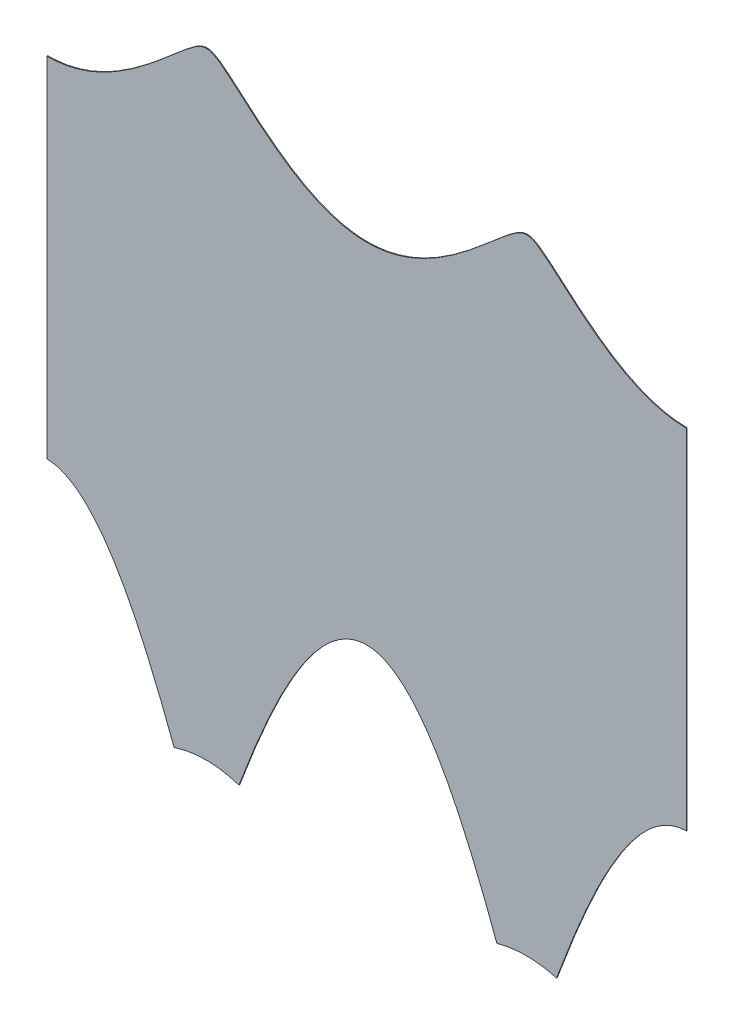
ISO-10303-21;
HEADER;
FILE_DESCRIPTION(('STEP AP214'),'2;1');
FILE_NAME('part.step','',(''),(''),'','','');
FILE_SCHEMA(('AUTOMOTIVE_DESIGN { 1 0 10303 214 1 1 1 1 }'));
ENDSEC;
DATA;
#1=APPLICATION_CONTEXT('core data for automotive mechanical design processes');
#2=APPLICATION_PROTOCOL_DEFINITION('international standard','automotive_design',2000,#1);
#3=PRODUCT_CONTEXT('',#1,'mechanical');
#4=PRODUCT('Part','Part','',(#3));
#5=PRODUCT_RELATED_PRODUCT_CATEGORY('part','',(#4));
#6=PRODUCT_DEFINITION_FORMATION('','',#4);
#7=PRODUCT_DEFINITION_CONTEXT('part definition',#1,'design');
#8=PRODUCT_DEFINITION('design','',#6,#7);
#9=PRODUCT_DEFINITION_SHAPE('','',#8);
#10=(LENGTH_UNIT() NAMED_UNIT(*) SI_UNIT(.MILLI.,.METRE.));
#11=(NAMED_UNIT(*) PLANE_ANGLE_UNIT() SI_UNIT($,.RADIAN.));
#12=(NAMED_UNIT(*) SI_UNIT($,.STERADIAN.) SOLID_ANGLE_UNIT());
#13=UNCERTAINTY_MEASURE_WITH_UNIT(LENGTH_MEASURE(1.E-05),#10,'distance_accuracy_value','');
#14=(GEOMETRIC_REPRESENTATION_CONTEXT(3) GLOBAL_UNCERTAINTY_ASSIGNED_CONTEXT((#13)) GLOBAL_UNIT_ASSIGNED_CONTEXT((#10,
#11,#12)) REPRESENTATION_CONTEXT('',''));
#15=CARTESIAN_POINT('',(0.,0.,0.));
#16=DIRECTION('',(0.,0.,1.));
#17=DIRECTION('',(1.,0.,0.));
#18=AXIS2_PLACEMENT_3D('',#15,#16,#17);
#19=CARTESIAN_POINT('',(296.680258206223,184.696980626435,12.6359293857901));
#20=CARTESIAN_POINT('',(297.3754412908,186.551085042336,12.6386880705448));
#21=CARTESIAN_POINT('',(297.984030245185,188.109322380884,12.6411031250932));
#22=CARTESIAN_POINT('',(298.05043121083,188.278883044933,12.6413666230632));
#23=CARTESIAN_POINT('',(298.739463929078,190.032917613039,12.6441009014102));
#24=CARTESIAN_POINT('',(299.383481104074,191.573529437103,12.6466565452425));
#25=CARTESIAN_POINT('',(299.453755634512,191.741031696174,12.6469354146224));
#26=CARTESIAN_POINT('',(300.179777092911,193.464076508492,12.6498164748399));
#27=CARTESIAN_POINT('',(300.877824726964,194.986210319269,12.6525865269439));
#28=CARTESIAN_POINT('',(300.954195008264,195.151935087413,12.6528895860019));
#29=CARTESIAN_POINT('',(301.744364795997,196.856670457464,12.6560252050861));
#30=CARTESIAN_POINT('',(302.512647995035,198.334882085358,12.6590739719441));
#31=CARTESIAN_POINT('',(302.597851921402,198.497743253963,12.6594120854251));
#32=CARTESIAN_POINT('',(303.489228242979,200.187787111727,12.6629493209011));
#33=CARTESIAN_POINT('',(304.360947042365,201.592616968101,12.6664085497223));
#34=CARTESIAN_POINT('',(304.459129003282,201.749342838788,12.666798163746));
#35=CARTESIAN_POINT('',(305.499157680634,203.389535548301,12.6709252941672));
#36=CARTESIAN_POINT('',(306.520367714815,204.639977321809,12.6749777468449));
#37=CARTESIAN_POINT('',(306.639966103548,204.78416574994,12.6754523473624));
#38=CARTESIAN_POINT('',(307.945566196519,206.325032266962,12.6806333409051));
#39=CARTESIAN_POINT('',(309.232379367453,207.246159987708,12.6857397825829));
#40=CARTESIAN_POINT('',(310.125453306936,207.863338989962,12.6892837546908));
#41=CARTESIAN_POINT('',(310.950747450248,208.169525999029,12.6925587572359));
#42=CARTESIAN_POINT('',(311.876502246125,208.512984261003,12.696232416303));
#43=CARTESIAN_POINT('',(312.800727548882,208.52205758361,12.6999000059052));
#44=B_SPLINE_CURVE_WITH_KNOTS('',2,(#19,#20,#21,#22,#23,#24,#25,#26,#27,#28,#29,#30,#31,#32,#33,
#34,#35,#36,#37,#38,#39,#40,#41,#42,#43),.UNSPECIFIED.,.F.,.F.,(3,1,1,1,1,1,1,1,1,1,1,1,1,1,1,1,
1,1,1,1,1,2,3),(0.,0.11875,0.125,0.13125,0.2440625,0.25,0.25625,0.3690625,0.375,0.38125,
0.4940625,0.5,0.50625,0.6190625,0.625,0.63125,0.7440625,0.75,0.75625,0.8690625,0.875,0.9375,1.),.UNSPECIFIED.);
#45=DIRECTION('',(0.00396825396825353,0.,-0.999992126449225));
#46=VECTOR('',#45,1.);
#47=SURFACE_OF_LINEAR_EXTRUSION('',#44,#46);
#48=CARTESIAN_POINT('',(296.68065503162,184.696980626435,12.5359301731452));
#49=CARTESIAN_POINT('',(297.375838116197,186.551085042336,12.5386888578999));
#50=CARTESIAN_POINT('',(297.984427070582,188.109322380884,12.5411039124482));
#51=CARTESIAN_POINT('',(298.050828036227,188.278883044933,12.5413674104183));
#52=CARTESIAN_POINT('',(298.739860754475,190.032917613039,12.5441016887652));
#53=CARTESIAN_POINT('',(299.383877929471,191.573529437103,12.5466573325975));
#54=CARTESIAN_POINT('',(299.454152459909,191.741031696174,12.5469362019775));
#55=CARTESIAN_POINT('',(300.180173918307,193.464076508492,12.549817262195));
#56=CARTESIAN_POINT('',(300.878221552361,194.986210319269,12.552587314299));
#57=CARTESIAN_POINT('',(300.954591833661,195.151935087413,12.552890373357));
#58=CARTESIAN_POINT('',(301.744761621394,196.856670457464,12.5560259924412));
#59=CARTESIAN_POINT('',(302.513044820432,198.334882085358,12.5590747592991));
#60=CARTESIAN_POINT('',(302.598248746799,198.497743253963,12.5594128727802));
#61=CARTESIAN_POINT('',(303.489625068376,200.187787111727,12.5629501082561));
#62=CARTESIAN_POINT('',(304.361343867762,201.592616968101,12.5664093370774));
#63=CARTESIAN_POINT('',(304.459525828679,201.749342838788,12.5667989511011));
#64=CARTESIAN_POINT('',(305.499554506031,203.389535548301,12.5709260815222));
#65=CARTESIAN_POINT('',(306.520764540212,204.639977321809,12.5749785342));
#66=CARTESIAN_POINT('',(306.640362928945,204.78416574994,12.5754531347175));
#67=CARTESIAN_POINT('',(307.945963021916,206.325032266962,12.5806341282602));
#68=CARTESIAN_POINT('',(309.23277619285,207.246159987708,12.5857405699379));
#69=CARTESIAN_POINT('',(310.125850132333,207.863338989962,12.5892845420459));
#70=CARTESIAN_POINT('',(310.951144275645,208.169525999029,12.592559544591));
#71=CARTESIAN_POINT('',(311.876899071522,208.512984261003,12.5962332036581));
#72=CARTESIAN_POINT('',(312.801124374278,208.52205758361,12.5999007932602));
#73=B_SPLINE_CURVE_WITH_KNOTS('',2,(#48,#49,#50,#51,#52,#53,#54,#55,#56,#57,#58,#59,#60,#61,#62,
#63,#64,#65,#66,#67,#68,#69,#70,#71,#72),.UNSPECIFIED.,.F.,.F.,(3,1,1,1,1,1,1,1,1,1,1,1,1,1,1,1,
1,1,1,1,1,2,3),(0.,0.11875,0.125,0.13125,0.2440625,0.25,0.25625,0.3690625,0.375,0.38125,
0.4940625,0.5,0.50625,0.6190625,0.625,0.63125,0.7440625,0.75,0.75625,0.8690625,0.875,0.9375,1.),.UNSPECIFIED.);
#74=CARTESIAN_POINT('',(296.680654547293,184.696980758885,12.5359301712233));
#75=VERTEX_POINT('',#74);
#76=CARTESIAN_POINT('',(312.801124374278,208.52205758361,12.5999007932602));
#77=VERTEX_POINT('',#76);
#78=EDGE_CURVE('E208',#75,#77,#73,.T.);
#79=ORIENTED_EDGE('',*,*,#78,.T.);
#80=DIRECTION('',(0.00396825396825353,0.,-0.999992126449225));
#81=VECTOR('',#80,1.);
#82=CARTESIAN_POINT('',(312.800727548882,208.52205758361,12.6999000059052));
#83=LINE('',#82,#81);
#84=CARTESIAN_POINT('',(312.800727548882,208.52205758361,12.6999000059052));
#85=VERTEX_POINT('',#84);
#86=EDGE_CURVE('E13',#85,#77,#83,.T.);
#87=ORIENTED_EDGE('',*,*,#86,.F.);
#88=CARTESIAN_POINT('',(296.680257721896,184.696980758885,12.6359293838682));
#89=VERTEX_POINT('',#88);
#90=EDGE_CURVE('E248',#89,#85,#44,.T.);
#91=ORIENTED_EDGE('',*,*,#90,.F.);
#92=DIRECTION('',(0.00396825396825353,0.,-0.999992126449225));
#93=VECTOR('',#92,1.);
#94=CARTESIAN_POINT('',(296.680257721896,184.696980758885,12.6359293838682));
#95=LINE('',#94,#93);
#96=EDGE_CURVE('E142',#89,#75,#95,.T.);
#97=ORIENTED_EDGE('',*,*,#96,.T.);
#98=EDGE_LOOP('',(#79,#87,#91,#97));
#99=FACE_BOUND('',#98,.T.);
#100=ADVANCED_FACE('F48',(#99),#47,.F.);
#101=CARTESIAN_POINT('',(312.800727548882,208.522057583609,12.6999000059052));
#102=DIRECTION('',(-0.999992126449225,0.,-0.00396825396825353));
#103=DIRECTION('',(-0.00396825396825353,0.,0.999992126449225));
#104=AXIS2_PLACEMENT_3D('',#101,#102,#103);
#105=PLANE('',#104);
#106=DIRECTION('',(0.,1.,0.));
#107=VECTOR('',#106,1.);
#108=CARTESIAN_POINT('',(312.801124374279,208.522057583609,12.5999007932602));
#109=LINE('',#108,#107);
#110=CARTESIAN_POINT('',(312.801124374278,251.643289139325,12.5999007932602));
#111=VERTEX_POINT('',#110);
#112=EDGE_CURVE('E199',#77,#111,#109,.T.);
#113=ORIENTED_EDGE('',*,*,#112,.T.);
#114=DIRECTION('',(0.00396825396825353,0.,-0.999992126449225));
#115=VECTOR('',#114,1.);
#116=CARTESIAN_POINT('',(312.800727548882,251.643289139325,12.6999000059052));
#117=LINE('',#116,#115);
#118=CARTESIAN_POINT('',(312.800727548882,251.643289139325,12.6999000059052));
#119=VERTEX_POINT('',#118);
#120=EDGE_CURVE('E57',#119,#111,#117,.T.);
#121=ORIENTED_EDGE('',*,*,#120,.F.);
#122=DIRECTION('',(0.,1.,0.));
#123=VECTOR('',#122,1.);
#124=CARTESIAN_POINT('',(312.800727548882,208.522057583609,12.6999000059052));
#125=LINE('',#124,#123);
#126=EDGE_CURVE('E108',#85,#119,#125,.T.);
#127=ORIENTED_EDGE('',*,*,#126,.F.);
#128=ORIENTED_EDGE('',*,*,#86,.T.);
#129=EDGE_LOOP('',(#113,#121,#127,#128));
#130=FACE_BOUND('',#129,.T.);
#131=ADVANCED_FACE('F192',(#130),#105,.F.);
#132=CARTESIAN_POINT('',(312.800727548882,251.643289139325,12.6999000059052));
#133=CARTESIAN_POINT('',(311.365765919289,251.648615460792,12.6942056688896));
#134=CARTESIAN_POINT('',(308.550586224924,252.254016620023,12.6830342329372));
#135=CARTESIAN_POINT('',(307.149245295213,252.826911409104,12.6774733124478));
#136=CARTESIAN_POINT('',(305.874040100489,253.348239513905,12.6724129345304));
#137=CARTESIAN_POINT('',(304.546401034632,254.11082422006,12.6671444840575));
#138=CARTESIAN_POINT('',(303.372316332122,254.785208592208,12.662485381094));
#139=CARTESIAN_POINT('',(302.122628358458,255.66860699073,12.6575262627876));
#140=CARTESIAN_POINT('',(301.032959897638,256.438888367759,12.6532021475477));
#141=CARTESIAN_POINT('',(299.816162527057,257.418775191386,12.6483735485351));
#142=CARTESIAN_POINT('',(299.292290026996,257.840649673105,12.6462946730397));
#143=CARTESIAN_POINT('',(298.706688209785,258.331894225574,12.643970838008));
#144=CARTESIAN_POINT('',(298.236338427218,258.726457154939,12.642104355921));
#145=CARTESIAN_POINT('',(297.613571644529,259.261101387714,12.6396330397062));
#146=CARTESIAN_POINT('',(297.4585679366,259.394171809591,12.6390179407841));
#147=CARTESIAN_POINT('',(296.715565694242,260.033814341814,12.6360694959728));
#148=CARTESIAN_POINT('',(296.522428300646,260.199111216491,12.6353030717097));
#149=CARTESIAN_POINT('',(296.208030433322,260.468189016011,12.6340554513019));
#150=CARTESIAN_POINT('',(295.660062887074,260.928281200153,12.6318809597911));
#151=CARTESIAN_POINT('',(295.094531287061,261.383563328113,12.6296367691054));
#152=CARTESIAN_POINT('',(294.506141775997,261.817639272644,12.6273018717093));
#153=CARTESIAN_POINT('',(294.236315151751,261.981280613327,12.6262311227063));
#154=CARTESIAN_POINT('',(293.880957233186,262.196793987441,12.6248209611328));
#155=CARTESIAN_POINT('',(293.404418663379,262.36322653996,12.6229299201729));
#156=CARTESIAN_POINT('',(293.051553014404,262.417906017778,12.621529648636));
#157=CARTESIAN_POINT('',(292.696507071157,262.393892042256,12.6201207250696));
#158=CARTESIAN_POINT('',(292.350902361156,262.298350735414,12.6187492670094));
#159=CARTESIAN_POINT('',(291.888939907599,262.093117574897,12.6169160682361));
#160=CARTESIAN_POINT('',(291.279483560279,261.693962191508,12.6144975716253));
#161=CARTESIAN_POINT('',(290.704001002614,261.255527316121,12.6122138927015));
#162=CARTESIAN_POINT('',(290.149458596221,260.802404190562,12.6100133102703));
#163=CARTESIAN_POINT('',(289.842208049769,260.542665105624,12.6087940524703));
#164=CARTESIAN_POINT('',(289.612010910932,260.348064331476,12.6078805645682));
#165=CARTESIAN_POINT('',(289.295811492452,260.076749800547,12.6066257950916));
#166=CARTESIAN_POINT('',(289.151659147246,259.953060054026,12.6060537574717));
#167=CARTESIAN_POINT('',(288.41165598092,259.316008072048,12.6031172138494));
#168=CARTESIAN_POINT('',(288.204466266676,259.138462270312,12.6022950259701));
#169=CARTESIAN_POINT('',(287.59453654204,258.615798959742,12.599874650863));
#170=CARTESIAN_POINT('',(287.113538012286,258.214040491411,12.59796591151));
#171=CARTESIAN_POINT('',(286.535933094297,257.731590644277,12.5956738104552));
#172=CARTESIAN_POINT('',(286.014258039482,257.313907408123,12.5936036550493));
#173=CARTESIAN_POINT('',(284.820146312939,256.357832461337,12.5888650791425));
#174=CARTESIAN_POINT('',(283.744608630912,255.602531457618,12.5845970388631));
#175=CARTESIAN_POINT('',(282.494238434961,254.724453562436,12.5796352133041));
#176=CARTESIAN_POINT('',(281.31810448218,254.055666380602,12.5749679783311));
#177=CARTESIAN_POINT('',(279.999958638919,253.306126720024,12.569737199673));
#178=CARTESIAN_POINT('',(278.732644518894,252.794773200548,12.5647081357906));
#179=CARTESIAN_POINT('',(277.343833839387,252.234396560195,12.5591969389078));
#180=CARTESIAN_POINT('',(274.553467527045,251.645451025282,12.5481239695324));
#181=CARTESIAN_POINT('',(271.704058310021,251.640966199399,12.5368167010714));
#182=CARTESIAN_POINT('',(268.902761373674,252.225675901751,12.5257003558624));
#183=CARTESIAN_POINT('',(267.507983301356,252.786537955398,12.5201654786629));
#184=CARTESIAN_POINT('',(266.237079805672,253.297588106476,12.5151221711142));
#185=CARTESIAN_POINT('',(264.915228349383,254.048194182678,12.5098766875267));
#186=CARTESIAN_POINT('',(263.743794591291,254.713386396607,12.5052281042668));
#187=CARTESIAN_POINT('',(262.499046987963,255.586061464204,12.5002885907589));
#188=CARTESIAN_POINT('',(261.411662827428,256.348411231548,12.4959735402741));
#189=CARTESIAN_POINT('',(260.203333132063,257.315982751633,12.4911785434118));
#190=CARTESIAN_POINT('',(259.679867998285,257.735148114483,12.4891012844621));
#191=CARTESIAN_POINT('',(259.09989407183,258.219679914295,12.4867997825059));
#192=CARTESIAN_POINT('',(258.620006666533,258.620595709971,12.4848954524117));
#193=CARTESIAN_POINT('',(258.010821322988,259.14265746864,12.4824780312211));
#194=CARTESIAN_POINT('',(257.805081471434,259.318973116855,12.4816615968105));
#195=CARTESIAN_POINT('',(257.067828075001,259.953660531335,12.4787359650594));
#196=CARTESIAN_POINT('',(256.922559291983,260.078304807113,12.4781594970959));
#197=CARTESIAN_POINT('',(256.604874401039,260.350886447398,12.4768988328408));
#198=CARTESIAN_POINT('',(256.373709312931,260.546270867789,12.47598150384));
#199=CARTESIAN_POINT('',(256.064841796853,260.807330619937,12.4747558294432));
#200=CARTESIAN_POINT('',(255.507430541499,261.262522068204,12.4725438626012));
#201=CARTESIAN_POINT('',(254.93146286137,261.700567986598,12.4702582585731));
#202=CARTESIAN_POINT('',(254.325343461816,262.096234130028,12.4678530039227));
#203=CARTESIAN_POINT('',(253.863970610676,262.300392284534,12.4660221448599));
#204=CARTESIAN_POINT('',(253.515563975022,262.395474365168,12.4646395679597));
#205=CARTESIAN_POINT('',(253.157493664819,262.417532321372,12.4632186428426));
#206=CARTESIAN_POINT('',(252.801776189525,262.359704149003,12.4618070544454));
#207=CARTESIAN_POINT('',(252.324351596468,262.189224670612,12.4599124974926));
#208=CARTESIAN_POINT('',(251.969438173651,261.972499239233,12.458504099805));
#209=CARTESIAN_POINT('',(251.699881133422,261.807896093595,12.4574344205883));
#210=CARTESIAN_POINT('',(251.112227331317,261.373087063874,12.4551024426952));
#211=CARTESIAN_POINT('',(250.548692015537,260.918809144468,12.4528661738347));
#212=CARTESIAN_POINT('',(250.003607435864,260.460916667228,12.4507031227575));
#213=CARTESIAN_POINT('',(249.690276711709,260.192710615942,12.4494597370781));
#214=CARTESIAN_POINT('',(249.498733372797,260.028752604106,12.4486996384787));
#215=CARTESIAN_POINT('',(248.758204086098,259.391231128988,12.4457610070607));
#216=CARTESIAN_POINT('',(248.598579362896,259.25420619382,12.445127570632));
#217=CARTESIAN_POINT('',(247.972596239898,258.716850230881,12.4426434910616));
#218=CARTESIAN_POINT('',(247.49882290646,258.319589032226,12.4407634233483));
#219=CARTESIAN_POINT('',(246.908028121497,257.824204788604,12.4384189811394));
#220=CARTESIAN_POINT('',(246.379347980328,257.398917065696,12.4363210275529));
#221=CARTESIAN_POINT('',(245.171497319345,256.427282201396,12.4315279316357));
#222=CARTESIAN_POINT('',(244.08834172557,255.662096467577,12.4272296613099));
#223=CARTESIAN_POINT('',(242.833501583886,254.775625696288,12.4222500977313));
#224=CARTESIAN_POINT('',(241.654654853736,254.099848618614,12.4175720976839));
#225=CARTESIAN_POINT('',(240.332959733789,253.342183314983,12.4123272344836));
#226=CARTESIAN_POINT('',(239.063103035359,252.823710482325,12.407288080925));
#227=CARTESIAN_POINT('',(237.664406931852,252.252633500403,12.4017376558603));
#228=CARTESIAN_POINT('',(234.853077857608,251.648610489582,12.3905815002668));
#229=CARTESIAN_POINT('',(233.419455519347,251.643289139325,12.3848924779412));
#230=B_SPLINE_CURVE_WITH_KNOTS('',2,(#132,#133,#134,#135,#136,#137,#138,#139,#140,#141,#142,
#143,#144,#145,#146,#147,#148,#149,#150,#151,#152,#153,#154,#155,#156,#157,#158,#159,#160,#161,
#162,#163,#164,#165,#166,#167,#168,#169,#170,#171,#172,#173,#174,#175,#176,#177,#178,#179,#180,
#181,#182,#183,#184,#185,#186,#187,#188,#189,#190,#191,#192,#193,#194,#195,#196,#197,#198,#199,
#200,#201,#202,#203,#204,#205,#206,#207,#208,#209,#210,#211,#212,#213,#214,#215,#216,#217,#218,
#219,#220,#221,#222,#223,#224,#225,#226,#227,#228,#229),.UNSPECIFIED.,.F.,.F.,(3,1,2,2,2,2,2,2,
1,2,1,1,1,2,1,1,1,1,1,1,1,1,2,2,1,2,2,2,2,2,2,1,1,1,2,2,2,2,2,2,1,2,2,1,1,1,1,1,1,1,1,2,1,1,1,2,
1,2,2,2,2,2,2,1,3),(0.,0.03125,0.0625,0.09375,0.125,0.15625,0.171875,0.1875,0.1953125,0.203125,
0.2109375,0.21875,0.2265625,0.234375,0.2421875,0.24609375,0.25,0.25390625,0.2578125,0.265625,
0.2734375,0.28125,0.2890625,0.296875,0.3046875,0.3125,0.328125,0.34375,0.375,0.40625,0.4375,
0.46875,0.5,0.53125,0.5625,0.59375,0.625,0.65625,0.671875,0.6875,0.6953125,0.703125,0.7109375,
0.71875,0.7265625,0.734375,0.7421875,0.74609375,0.75,0.75390625,0.7578125,0.765625,0.7734375,
0.78125,0.7890625,0.796875,0.8046875,0.8125,0.828125,0.84375,0.875,0.90625,0.9375,0.96875,1.),.UNSPECIFIED.);
#231=DIRECTION('',(0.00396825396825353,0.,-0.999992126449225));
#232=VECTOR('',#231,1.);
#233=SURFACE_OF_LINEAR_EXTRUSION('',#230,#232);
#234=CARTESIAN_POINT('',(312.801124374278,251.643289139325,12.5999007932602));
#235=CARTESIAN_POINT('',(311.366162744686,251.648615460792,12.5942064562447));
#236=CARTESIAN_POINT('',(308.550983050321,252.254016620023,12.5830350202923));
#237=CARTESIAN_POINT('',(307.14964212061,252.826911409104,12.5774740998029));
#238=CARTESIAN_POINT('',(305.874436925886,253.348239513905,12.5724137218855));
#239=CARTESIAN_POINT('',(304.546797860029,254.11082422006,12.5671452714125));
#240=CARTESIAN_POINT('',(303.372713157518,254.785208592208,12.5624861684491));
#241=CARTESIAN_POINT('',(302.123025183855,255.66860699073,12.5575270501426));
#242=CARTESIAN_POINT('',(301.033356723035,256.438888367759,12.5532029349027));
#243=CARTESIAN_POINT('',(299.816559352454,257.418775191386,12.5483743358902));
#244=CARTESIAN_POINT('',(299.292686852393,257.840649673105,12.5462954603948));
#245=CARTESIAN_POINT('',(298.707085035182,258.331894225574,12.543971625363));
#246=CARTESIAN_POINT('',(298.236735252615,258.726457154939,12.542105143276));
#247=CARTESIAN_POINT('',(297.613968469926,259.261101387714,12.5396338270613));
#248=CARTESIAN_POINT('',(297.458964761997,259.394171809591,12.5390187281392));
#249=CARTESIAN_POINT('',(296.715962519639,260.033814341814,12.5360702833278));
#250=CARTESIAN_POINT('',(296.522825126043,260.199111216491,12.5353038590648));
#251=CARTESIAN_POINT('',(296.208427258719,260.468189016011,12.5340562386569));
#252=CARTESIAN_POINT('',(295.660459712471,260.928281200153,12.5318817471461));
#253=CARTESIAN_POINT('',(295.094928112458,261.383563328113,12.5296375564604));
#254=CARTESIAN_POINT('',(294.506538601394,261.817639272644,12.5273026590643));
#255=CARTESIAN_POINT('',(294.236711977148,261.981280613327,12.5262319100613));
#256=CARTESIAN_POINT('',(293.881354058582,262.196793987441,12.5248217484879));
#257=CARTESIAN_POINT('',(293.404815488776,262.36322653996,12.522930707528));
#258=CARTESIAN_POINT('',(293.051949839801,262.417906017778,12.5215304359911));
#259=CARTESIAN_POINT('',(292.696903896554,262.393892042256,12.5201215124246));
#260=CARTESIAN_POINT('',(292.351299186553,262.298350735414,12.5187500543645));
#261=CARTESIAN_POINT('',(291.889336732996,262.093117574897,12.5169168555912));
#262=CARTESIAN_POINT('',(291.279880385676,261.693962191508,12.5144983589803));
#263=CARTESIAN_POINT('',(290.704397828011,261.255527316121,12.5122146800565));
#264=CARTESIAN_POINT('',(290.149855421618,260.802404190562,12.5100140976254));
#265=CARTESIAN_POINT('',(289.842604875166,260.542665105624,12.5087948398253));
#266=CARTESIAN_POINT('',(289.612407736329,260.348064331476,12.5078813519232));
#267=CARTESIAN_POINT('',(289.296208317849,260.076749800547,12.5066265824466));
#268=CARTESIAN_POINT('',(289.152055972643,259.953060054026,12.5060545448267));
#269=CARTESIAN_POINT('',(288.412052806317,259.316008072048,12.5031180012044));
#270=CARTESIAN_POINT('',(288.204863092073,259.138462270312,12.5022958133252));
#271=CARTESIAN_POINT('',(287.594933367437,258.615798959742,12.4998754382181));
#272=CARTESIAN_POINT('',(287.113934837683,258.214040491411,12.4979666988651));
#273=CARTESIAN_POINT('',(286.536329919694,257.731590644277,12.4956745978102));
#274=CARTESIAN_POINT('',(286.014654864879,257.313907408123,12.4936044424044));
#275=CARTESIAN_POINT('',(284.820543138336,256.357832461337,12.4888658664975));
#276=CARTESIAN_POINT('',(283.745005456309,255.602531457618,12.4845978262182));
#277=CARTESIAN_POINT('',(282.494635260358,254.724453562436,12.4796360006591));
#278=CARTESIAN_POINT('',(281.318501307576,254.055666380602,12.4749687656861));
#279=CARTESIAN_POINT('',(280.000355464315,253.306126720024,12.4697379870281));
#280=CARTESIAN_POINT('',(278.733041344291,252.794773200548,12.4647089231456));
#281=CARTESIAN_POINT('',(277.344230664783,252.234396560195,12.4591977262629));
#282=CARTESIAN_POINT('',(274.553864352442,251.645451025282,12.4481247568874));
#283=CARTESIAN_POINT('',(271.704455135418,251.640966199399,12.4368174884264));
#284=CARTESIAN_POINT('',(268.903158199071,252.225675901751,12.4257011432174));
#285=CARTESIAN_POINT('',(267.508380126753,252.786537955398,12.420166266018));
#286=CARTESIAN_POINT('',(266.237476631069,253.297588106476,12.4151229584692));
#287=CARTESIAN_POINT('',(264.91562517478,254.048194182678,12.4098774748818));
#288=CARTESIAN_POINT('',(263.744191416688,254.713386396607,12.4052288916218));
#289=CARTESIAN_POINT('',(262.49944381336,255.586061464204,12.4002893781139));
#290=CARTESIAN_POINT('',(261.412059652825,256.348411231548,12.3959743276291));
#291=CARTESIAN_POINT('',(260.20372995746,257.315982751633,12.3911793307669));
#292=CARTESIAN_POINT('',(259.680264823682,257.735148114483,12.3891020718171));
#293=CARTESIAN_POINT('',(259.100290897227,258.219679914295,12.386800569861));
#294=CARTESIAN_POINT('',(258.62040349193,258.620595709971,12.3848962397668));
#295=CARTESIAN_POINT('',(258.011218148385,259.14265746864,12.3824788185761));
#296=CARTESIAN_POINT('',(257.805478296831,259.318973116855,12.3816623841655));
#297=CARTESIAN_POINT('',(257.068224900398,259.953660531335,12.3787367524144));
#298=CARTESIAN_POINT('',(256.92295611738,260.078304807113,12.3781602844509));
#299=CARTESIAN_POINT('',(256.605271226436,260.350886447398,12.3768996201959));
#300=CARTESIAN_POINT('',(256.374106138328,260.546270867789,12.375982291195));
#301=CARTESIAN_POINT('',(256.06523862225,260.807330619937,12.3747566167983));
#302=CARTESIAN_POINT('',(255.507827366896,261.262522068204,12.3725446499562));
#303=CARTESIAN_POINT('',(254.931859686767,261.700567986598,12.3702590459282));
#304=CARTESIAN_POINT('',(254.325740287213,262.096234130028,12.3678537912777));
#305=CARTESIAN_POINT('',(253.864367436073,262.300392284534,12.366022932215));
#306=CARTESIAN_POINT('',(253.515960800418,262.395474365168,12.3646403553147));
#307=CARTESIAN_POINT('',(253.157890490216,262.417532321372,12.3632194301976));
#308=CARTESIAN_POINT('',(252.802173014922,262.359704149003,12.3618078418005));
#309=CARTESIAN_POINT('',(252.324748421865,262.189224670612,12.3599132848477));
#310=CARTESIAN_POINT('',(251.969834999048,261.972499239233,12.3585048871601));
#311=CARTESIAN_POINT('',(251.700277958819,261.807896093595,12.3574352079433));
#312=CARTESIAN_POINT('',(251.112624156714,261.373087063874,12.3551032300502));
#313=CARTESIAN_POINT('',(250.549088840934,260.918809144468,12.3528669611898));
#314=CARTESIAN_POINT('',(250.004004261261,260.460916667228,12.3507039101126));
#315=CARTESIAN_POINT('',(249.690673537106,260.192710615942,12.3494605244332));
#316=CARTESIAN_POINT('',(249.499130198194,260.028752604106,12.3487004258338));
#317=CARTESIAN_POINT('',(248.758600911494,259.391231128988,12.3457617944158));
#318=CARTESIAN_POINT('',(248.598976188293,259.25420619382,12.3451283579871));
#319=CARTESIAN_POINT('',(247.972993065295,258.716850230881,12.3426442784167));
#320=CARTESIAN_POINT('',(247.499219731857,258.319589032226,12.3407642107034));
#321=CARTESIAN_POINT('',(246.908424946894,257.824204788604,12.3384197684945));
#322=CARTESIAN_POINT('',(246.379744805725,257.398917065696,12.336321814908));
#323=CARTESIAN_POINT('',(245.171894144742,256.427282201396,12.3315287189908));
#324=CARTESIAN_POINT('',(244.088738550966,255.662096467577,12.3272304486649));
#325=CARTESIAN_POINT('',(242.833898409283,254.775625696288,12.3222508850863));
#326=CARTESIAN_POINT('',(241.655051679133,254.099848618614,12.317572885039));
#327=CARTESIAN_POINT('',(240.333356559185,253.342183314983,12.3123280218387));
#328=CARTESIAN_POINT('',(239.063499860755,252.823710482325,12.30728886828));
#329=CARTESIAN_POINT('',(237.664803757248,252.252633500403,12.3017384432153));
#330=CARTESIAN_POINT('',(234.853474683005,251.648610489582,12.2905822876219));
#331=CARTESIAN_POINT('',(233.419852344744,251.643289139325,12.2848932652963));
#332=B_SPLINE_CURVE_WITH_KNOTS('',2,(#234,#235,#236,#237,#238,#239,#240,#241,#242,#243,#244,
#245,#246,#247,#248,#249,#250,#251,#252,#253,#254,#255,#256,#257,#258,#259,#260,#261,#262,#263,
#264,#265,#266,#267,#268,#269,#270,#271,#272,#273,#274,#275,#276,#277,#278,#279,#280,#281,#282,
#283,#284,#285,#286,#287,#288,#289,#290,#291,#292,#293,#294,#295,#296,#297,#298,#299,#300,#301,
#302,#303,#304,#305,#306,#307,#308,#309,#310,#311,#312,#313,#314,#315,#316,#317,#318,#319,#320,
#321,#322,#323,#324,#325,#326,#327,#328,#329,#330,#331),.UNSPECIFIED.,.F.,.F.,(3,1,2,2,2,2,2,2,
1,2,1,1,1,2,1,1,1,1,1,1,1,1,2,2,1,2,2,2,2,2,2,1,1,1,2,2,2,2,2,2,1,2,2,1,1,1,1,1,1,1,1,2,1,1,1,2,
1,2,2,2,2,2,2,1,3),(0.,0.03125,0.0625,0.09375,0.125,0.15625,0.171875,0.1875,0.1953125,0.203125,
0.2109375,0.21875,0.2265625,0.234375,0.2421875,0.24609375,0.25,0.25390625,0.2578125,0.265625,
0.2734375,0.28125,0.2890625,0.296875,0.3046875,0.3125,0.328125,0.34375,0.375,0.40625,0.4375,
0.46875,0.5,0.53125,0.5625,0.59375,0.625,0.65625,0.671875,0.6875,0.6953125,0.703125,0.7109375,
0.71875,0.7265625,0.734375,0.7421875,0.74609375,0.75,0.75390625,0.7578125,0.765625,0.7734375,
0.78125,0.7890625,0.796875,0.8046875,0.8125,0.828125,0.84375,0.875,0.90625,0.9375,0.96875,1.),.UNSPECIFIED.);
#333=CARTESIAN_POINT('',(233.419852344744,251.643289139325,12.2848932652963));
#334=VERTEX_POINT('',#333);
#335=EDGE_CURVE('E207',#111,#334,#332,.T.);
#336=ORIENTED_EDGE('',*,*,#335,.T.);
#337=DIRECTION('',(0.00396825396825353,0.,-0.999992126449225));
#338=VECTOR('',#337,1.);
#339=CARTESIAN_POINT('',(233.419455519347,251.643289139325,12.3848924779412));
#340=LINE('',#339,#338);
#341=CARTESIAN_POINT('',(233.419455519347,251.643289139325,12.3848924779412));
#342=VERTEX_POINT('',#341);
#343=EDGE_CURVE('E213',#342,#334,#340,.T.);
#344=ORIENTED_EDGE('',*,*,#343,.F.);
#345=EDGE_CURVE('E182',#119,#342,#230,.T.);
#346=ORIENTED_EDGE('',*,*,#345,.F.);
#347=ORIENTED_EDGE('',*,*,#120,.T.);
#348=EDGE_LOOP('',(#336,#344,#346,#347));
#349=FACE_BOUND('',#348,.T.);
#350=ADVANCED_FACE('F190',(#349),#233,.F.);
#351=CARTESIAN_POINT('',(233.419455519348,208.522057583609,12.3848924779412));
#352=DIRECTION('',(-0.999992126449225,0.,-0.00396825396825353));
#353=DIRECTION('',(-0.00396825396825353,0.,0.999992126449225));
#354=AXIS2_PLACEMENT_3D('',#351,#352,#353);
#355=PLANE('',#354);
#356=DIRECTION('',(0.,1.,0.));
#357=VECTOR('',#356,1.);
#358=CARTESIAN_POINT('',(233.419852344744,208.522057583609,12.2848932652963));
#359=LINE('',#358,#357);
#360=CARTESIAN_POINT('',(233.419852344744,208.52205758361,12.2848932652963));
#361=VERTEX_POINT('',#360);
#362=EDGE_CURVE('E217',#361,#334,#359,.T.);
#363=ORIENTED_EDGE('',*,*,#362,.F.);
#364=DIRECTION('',(0.00396825396825353,0.,-0.999992126449225));
#365=VECTOR('',#364,1.);
#366=CARTESIAN_POINT('',(233.419455519348,208.52205758361,12.3848924779412));
#367=LINE('',#366,#365);
#368=CARTESIAN_POINT('',(233.419455519348,208.52205758361,12.3848924779412));
#369=VERTEX_POINT('',#368);
#370=EDGE_CURVE('E255',#369,#361,#367,.T.);
#371=ORIENTED_EDGE('',*,*,#370,.F.);
#372=DIRECTION('',(0.,1.,0.));
#373=VECTOR('',#372,1.);
#374=CARTESIAN_POINT('',(233.419455519348,208.522057583609,12.3848924779412));
#375=LINE('',#374,#373);
#376=EDGE_CURVE('E176',#369,#342,#375,.T.);
#377=ORIENTED_EDGE('',*,*,#376,.T.);
#378=ORIENTED_EDGE('',*,*,#343,.T.);
#379=EDGE_LOOP('',(#363,#371,#377,#378));
#380=FACE_BOUND('',#379,.T.);
#381=ADVANCED_FACE('F169',(#380),#355,.T.);
#382=CARTESIAN_POINT('',(233.419455519347,208.52205758361,12.3848924779412));
#383=CARTESIAN_POINT('',(235.042977344314,208.506119113592,12.3913350755918));
#384=CARTESIAN_POINT('',(236.761046350593,207.401038836801,12.3981528634239));
#385=CARTESIAN_POINT('',(236.91332314588,207.298044696862,12.3987571411789));
#386=CARTESIAN_POINT('',(238.17807876928,206.410293782966,12.403776052217));
#387=CARTESIAN_POINT('',(239.453908499933,204.933309261501,12.4088389084711));
#388=CARTESIAN_POINT('',(239.570721741638,204.795309828961,12.4093024567308));
#389=CARTESIAN_POINT('',(240.580909816573,203.582066249141,12.4133111711307));
#390=CARTESIAN_POINT('',(241.603662596307,201.99686533495,12.4173697458628));
#391=CARTESIAN_POINT('',(241.699946581562,201.845890811375,12.4177518281777));
#392=CARTESIAN_POINT('',(242.560120289993,200.483446912053,12.4211652427853));
#393=CARTESIAN_POINT('',(243.434213843312,198.852927624016,12.4246338953074));
#394=CARTESIAN_POINT('',(243.517799124377,198.695794926262,12.4249655855423));
#395=CARTESIAN_POINT('',(244.27773144568,197.257157585975,12.4279812137356));
#396=CARTESIAN_POINT('',(245.053992825489,195.6072119742,12.4310616402903));
#397=CARTESIAN_POINT('',(245.128796308266,195.447324753311,12.4313584818449));
#398=CARTESIAN_POINT('',(245.814776200563,193.973535177237,12.4340806457078));
#399=CARTESIAN_POINT('',(246.522018823558,192.318299747079,12.4368871861504));
#400=CARTESIAN_POINT('',(246.590477711993,192.15741014193,12.4371588505451));
#401=CARTESIAN_POINT('',(247.221781763851,190.667995341309,12.4396640450788));
#402=CARTESIAN_POINT('',(247.886840378873,188.995808729958,12.4423031873464));
#403=CARTESIAN_POINT('',(247.950290165475,188.835785163191,12.4425549741963));
#404=CARTESIAN_POINT('',(248.55689029332,187.301618333255,12.4449621365137));
#405=CARTESIAN_POINT('',(249.214868712902,185.560640848492,12.4475731825464));
#406=B_SPLINE_CURVE_WITH_KNOTS('',2,(#382,#383,#384,#385,#386,#387,#388,#389,#390,#391,#392,
#393,#394,#395,#396,#397,#398,#399,#400,#401,#402,#403,#404,#405),.UNSPECIFIED.,.F.,.F.,(3,1,1,
1,1,1,1,1,1,1,1,1,1,1,1,1,1,1,1,1,1,1,3),(0.,0.11875,0.125,0.13125,0.2440625,0.25,0.25625,
0.3690625,0.375,0.38125,0.4940625,0.5,0.50625,0.6190625,0.625,0.63125,0.7440625,0.75,0.75625,
0.8690625,0.875,0.88125,1.),.UNSPECIFIED.);
#407=DIRECTION('',(0.00396825396825353,0.,-0.999992126449225));
#408=VECTOR('',#407,1.);
#409=SURFACE_OF_LINEAR_EXTRUSION('',#406,#408);
#410=CARTESIAN_POINT('',(233.419852344744,208.52205758361,12.2848932652963));
#411=CARTESIAN_POINT('',(235.04337416971,208.506119113592,12.2913358629469));
#412=CARTESIAN_POINT('',(236.76144317599,207.401038836801,12.298153650779));
#413=CARTESIAN_POINT('',(236.913719971277,207.298044696862,12.2987579285339));
#414=CARTESIAN_POINT('',(238.178475594676,206.410293782966,12.303776839572));
#415=CARTESIAN_POINT('',(239.454305325329,204.933309261501,12.3088396958261));
#416=CARTESIAN_POINT('',(239.571118567035,204.795309828961,12.3093032440859));
#417=CARTESIAN_POINT('',(240.581306641969,203.582066249141,12.3133119584857));
#418=CARTESIAN_POINT('',(241.604059421704,201.99686533495,12.3173705332178));
#419=CARTESIAN_POINT('',(241.700343406959,201.845890811375,12.3177526155327));
#420=CARTESIAN_POINT('',(242.56051711539,200.483446912053,12.3211660301403));
#421=CARTESIAN_POINT('',(243.434610668709,198.852927624016,12.3246346826625));
#422=CARTESIAN_POINT('',(243.518195949773,198.695794926262,12.3249663728974));
#423=CARTESIAN_POINT('',(244.278128271077,197.257157585975,12.3279820010907));
#424=CARTESIAN_POINT('',(245.054389650886,195.6072119742,12.3310624276454));
#425=CARTESIAN_POINT('',(245.129193133663,195.447324753311,12.3313592692));
#426=CARTESIAN_POINT('',(245.815173025959,193.973535177237,12.3340814330628));
#427=CARTESIAN_POINT('',(246.522415648955,192.318299747079,12.3368879735055));
#428=CARTESIAN_POINT('',(246.59087453739,192.15741014193,12.3371596379001));
#429=CARTESIAN_POINT('',(247.222178589247,190.667995341309,12.3396648324339));
#430=CARTESIAN_POINT('',(247.88723720427,188.995808729958,12.3423039747015));
#431=CARTESIAN_POINT('',(247.950686990872,188.835785163191,12.3425557615514));
#432=CARTESIAN_POINT('',(248.557287118716,187.301618333255,12.3449629238688));
#433=CARTESIAN_POINT('',(249.215265538298,185.560640848492,12.3475739699015));
#434=B_SPLINE_CURVE_WITH_KNOTS('',2,(#410,#411,#412,#413,#414,#415,#416,#417,#418,#419,#420,
#421,#422,#423,#424,#425,#426,#427,#428,#429,#430,#431,#432,#433),.UNSPECIFIED.,.F.,.F.,(3,1,1,
1,1,1,1,1,1,1,1,1,1,1,1,1,1,1,1,1,1,1,3),(0.,0.11875,0.125,0.13125,0.2440625,0.25,0.25625,
0.3690625,0.375,0.38125,0.4940625,0.5,0.50625,0.6190625,0.625,0.63125,0.7440625,0.75,0.75625,
0.8690625,0.875,0.88125,1.),.UNSPECIFIED.);
#435=CARTESIAN_POINT('',(249.215265360621,185.560641318617,12.3475739691964));
#436=VERTEX_POINT('',#435);
#437=EDGE_CURVE('E219',#361,#436,#434,.T.);
#438=ORIENTED_EDGE('',*,*,#437,.T.);
#439=DIRECTION('',(0.00396825396825353,0.,-0.999992126449225));
#440=VECTOR('',#439,1.);
#441=CARTESIAN_POINT('',(249.214868535224,185.560641318617,12.4475731818414));
#442=LINE('',#441,#440);
#443=CARTESIAN_POINT('',(249.214868535224,185.560641318617,12.4475731818414));
#444=VERTEX_POINT('',#443);
#445=EDGE_CURVE('E137',#444,#436,#442,.T.);
#446=ORIENTED_EDGE('',*,*,#445,.F.);
#447=EDGE_CURVE('E128',#369,#444,#406,.T.);
#448=ORIENTED_EDGE('',*,*,#447,.F.);
#449=ORIENTED_EDGE('',*,*,#370,.T.);
#450=EDGE_LOOP('',(#438,#446,#448,#449));
#451=FACE_BOUND('',#450,.T.);
#452=ADVANCED_FACE('F166',(#451),#409,.F.);
#453=CARTESIAN_POINT('',(249.214868712901,185.560640848492,12.4475731825464));
#454=CARTESIAN_POINT('',(250.212904118306,185.881583019279,12.4515336716875));
#455=CARTESIAN_POINT('',(252.221161395956,186.213597719088,12.4595030093458));
#456=CARTESIAN_POINT('',(254.256095797,186.213533820023,12.4675782094384));
#457=CARTESIAN_POINT('',(256.263921216741,185.882394533356,12.4755458333613));
#458=CARTESIAN_POINT('',(257.264480191356,185.560640848492,12.4795163367448));
#459=B_SPLINE_CURVE_WITH_KNOTS('',2,(#453,#454,#455,#456,#457,#458),.UNSPECIFIED.,.F.,.F.,(3,1,
1,1,3),(0.,0.25,0.5,0.75,1.),.UNSPECIFIED.);
#460=DIRECTION('',(0.00396825396825353,0.,-0.999992126449225));
#461=VECTOR('',#460,1.);
#462=SURFACE_OF_LINEAR_EXTRUSION('',#459,#461);
#463=CARTESIAN_POINT('',(249.215265538298,185.560640848492,12.3475739699015));
#464=CARTESIAN_POINT('',(250.213300943702,185.881583019279,12.3515344590426));
#465=CARTESIAN_POINT('',(252.221558221353,186.213597719088,12.3595037967009));
#466=CARTESIAN_POINT('',(254.256492622397,186.213533820023,12.3675789967934));
#467=CARTESIAN_POINT('',(256.264318042138,185.882394533356,12.3755466207164));
#468=CARTESIAN_POINT('',(257.264877016753,185.560640848492,12.3795171240998));
#469=B_SPLINE_CURVE_WITH_KNOTS('',2,(#463,#464,#465,#466,#467,#468),.UNSPECIFIED.,.F.,.F.,(3,1,
1,1,3),(0.,0.25,0.5,0.75,1.),.UNSPECIFIED.);
#470=CARTESIAN_POINT('',(257.264876540158,185.560641001752,12.3795171222086));
#471=VERTEX_POINT('',#470);
#472=EDGE_CURVE('E136',#436,#471,#469,.T.);
#473=ORIENTED_EDGE('',*,*,#472,.T.);
#474=DIRECTION('',(0.00396825396825353,0.,-0.999992126449225));
#475=VECTOR('',#474,1.);
#476=CARTESIAN_POINT('',(257.264479714761,185.560641001752,12.4795163348535));
#477=LINE('',#476,#475);
#478=CARTESIAN_POINT('',(257.264479714761,185.560641001752,12.4795163348535));
#479=VERTEX_POINT('',#478);
#480=EDGE_CURVE('E133',#479,#471,#477,.T.);
#481=ORIENTED_EDGE('',*,*,#480,.F.);
#482=EDGE_CURVE('E121',#444,#479,#459,.T.);
#483=ORIENTED_EDGE('',*,*,#482,.F.);
#484=ORIENTED_EDGE('',*,*,#445,.T.);
#485=EDGE_LOOP('',(#473,#481,#483,#484));
#486=FACE_BOUND('',#485,.T.);
#487=ADVANCED_FACE('F134',(#486),#462,.F.);
#488=CARTESIAN_POINT('',(257.264480191356,185.560640848492,12.4795163367448));
#489=CARTESIAN_POINT('',(257.974555661284,187.439464482879,12.482334118732));
#490=CARTESIAN_POINT('',(258.590791666501,188.991421783724,12.4847795189591));
#491=CARTESIAN_POINT('',(259.311056549461,190.805370229103,12.4876377354434));
#492=CARTESIAN_POINT('',(259.988879414075,192.392138577343,12.4903275298939));
#493=CARTESIAN_POINT('',(260.755879832112,194.187669607594,12.493371206311));
#494=CARTESIAN_POINT('',(261.495212056866,195.755619309493,12.4963050874458));
#495=CARTESIAN_POINT('',(262.335984797049,197.53870047814,12.4996415134779));
#496=CARTESIAN_POINT('',(263.154865341635,199.05725736253,12.502891065034));
#497=CARTESIAN_POINT('',(264.103503302251,200.816440329337,12.5066555310254));
#498=CARTESIAN_POINT('',(265.032815829182,202.239417518971,12.510343308184));
#499=CARTESIAN_POINT('',(266.14562874024,203.94337323126,12.5147592672035));
#500=CARTESIAN_POINT('',(267.240371476123,205.18001528887,12.5191035186141));
#501=CARTESIAN_POINT('',(268.649660777046,206.771975083384,12.5246959805074));
#502=CARTESIAN_POINT('',(270.041958758128,207.603796081843,12.5302210159975));
#503=CARTESIAN_POINT('',(270.891662828468,208.111447244015,12.533592884095));
#504=CARTESIAN_POINT('',(272.663485752481,208.58634704529,12.540623982804));
#505=CARTESIAN_POINT('',(273.587864340268,208.499984124344,12.5442921806849));
#506=CARTESIAN_POINT('',(275.274533991519,208.342401809395,12.5509853669208));
#507=CARTESIAN_POINT('',(276.972745176352,207.068335267511,12.5577243532537));
#508=CARTESIAN_POINT('',(278.270677604211,206.094573997576,12.5628749193143));
#509=CARTESIAN_POINT('',(279.586062416359,204.461108012392,12.5680947414134));
#510=CARTESIAN_POINT('',(280.630264275134,203.164401373983,12.5722384322087));
#511=CARTESIAN_POINT('',(281.692773386854,201.443011766101,12.5764547714052));
#512=CARTESIAN_POINT('',(282.5852885951,199.997032256464,12.5799965263082));
#513=CARTESIAN_POINT('',(283.497382154329,198.240571503582,12.5836159736919));
#514=CARTESIAN_POINT('',(284.29261658744,196.709151774799,12.5867716907335));
#515=CARTESIAN_POINT('',(285.110673634253,194.926283452866,12.5900179744156));
#516=CARTESIAN_POINT('',(285.83282913955,193.35242234022,12.5928836934285));
#517=CARTESIAN_POINT('',(286.584995749057,191.555645023005,12.5958685050626));
#518=CARTESIAN_POINT('',(287.250173192258,189.966667625231,12.5985081188743));
#519=CARTESIAN_POINT('',(287.964985325877,188.13995217982,12.601344697294));
#520=CARTESIAN_POINT('',(288.559252674649,186.621291130787,12.6037029196265));
#521=CARTESIAN_POINT('',(289.280759025978,184.696980626435,12.6065660626114));
#522=B_SPLINE_CURVE_WITH_KNOTS('',2,(#488,#489,#490,#491,#492,#493,#494,#495,#496,#497,#498,
#499,#500,#501,#502,#503,#504,#505,#506,#507,#508,#509,#510,#511,#512,#513,#514,#515,#516,#517,
#518,#519,#520,#521),.UNSPECIFIED.,.F.,.F.,(3,2,2,2,2,2,2,2,1,2,2,2,2,2,2,2,2,3),(0.,0.0625,
0.125,0.1875,0.25,0.3125,0.375,0.4375,0.46875,0.5,0.5625,0.625,0.6875,0.75,0.8125,0.875,0.9375,
1.),.UNSPECIFIED.);
#523=DIRECTION('',(0.00396825396825353,0.,-0.999992126449225));
#524=VECTOR('',#523,1.);
#525=SURFACE_OF_LINEAR_EXTRUSION('',#522,#524);
#526=CARTESIAN_POINT('',(257.264877016753,185.560640848492,12.3795171240998));
#527=CARTESIAN_POINT('',(257.97495248668,187.439464482879,12.3823349060871));
#528=CARTESIAN_POINT('',(258.591188491898,188.991421783724,12.3847803063141));
#529=CARTESIAN_POINT('',(259.311453374858,190.805370229103,12.3876385227985));
#530=CARTESIAN_POINT('',(259.989276239471,192.392138577343,12.390328317249));
#531=CARTESIAN_POINT('',(260.756276657509,194.187669607594,12.393371993666));
#532=CARTESIAN_POINT('',(261.495608882263,195.755619309493,12.3963058748008));
#533=CARTESIAN_POINT('',(262.336381622446,197.53870047814,12.399642300833));
#534=CARTESIAN_POINT('',(263.155262167032,199.05725736253,12.4028918523891));
#535=CARTESIAN_POINT('',(264.103900127648,200.816440329337,12.4066563183804));
#536=CARTESIAN_POINT('',(265.033212654578,202.239417518971,12.4103440955391));
#537=CARTESIAN_POINT('',(266.146025565637,203.94337323126,12.4147600545586));
#538=CARTESIAN_POINT('',(267.24076830152,205.18001528887,12.4191043059691));
#539=CARTESIAN_POINT('',(268.650057602443,206.771975083384,12.4246967678625));
#540=CARTESIAN_POINT('',(270.042355583524,207.603796081843,12.4302218033526));
#541=CARTESIAN_POINT('',(270.892059653865,208.111447244015,12.4335936714501));
#542=CARTESIAN_POINT('',(272.663882577878,208.58634704529,12.4406247701591));
#543=CARTESIAN_POINT('',(273.588261165665,208.499984124344,12.44429296804));
#544=CARTESIAN_POINT('',(275.274930816916,208.342401809395,12.4509861542758));
#545=CARTESIAN_POINT('',(276.973142001749,207.068335267511,12.4577251406087));
#546=CARTESIAN_POINT('',(278.271074429608,206.094573997576,12.4628757066693));
#547=CARTESIAN_POINT('',(279.586459241756,204.461108012392,12.4680955287685));
#548=CARTESIAN_POINT('',(280.630661100531,203.164401373983,12.4722392195638));
#549=CARTESIAN_POINT('',(281.693170212251,201.443011766101,12.4764555587602));
#550=CARTESIAN_POINT('',(282.585685420496,199.997032256464,12.4799973136632));
#551=CARTESIAN_POINT('',(283.497778979726,198.240571503582,12.483616761047));
#552=CARTESIAN_POINT('',(284.293013412837,196.709151774799,12.4867724780886));
#553=CARTESIAN_POINT('',(285.111070459649,194.926283452866,12.4900187617706));
#554=CARTESIAN_POINT('',(285.833225964947,193.35242234022,12.4928844807836));
#555=CARTESIAN_POINT('',(286.585392574454,191.555645023005,12.4958692924176));
#556=CARTESIAN_POINT('',(287.250570017655,189.966667625231,12.4985089062293));
#557=CARTESIAN_POINT('',(287.965382151274,188.13995217982,12.5013454846491));
#558=CARTESIAN_POINT('',(288.559649500045,186.621291130787,12.5037037069816));
#559=CARTESIAN_POINT('',(289.281155851375,184.696980626435,12.5065668499665));
#560=B_SPLINE_CURVE_WITH_KNOTS('',2,(#526,#527,#528,#529,#530,#531,#532,#533,#534,#535,#536,
#537,#538,#539,#540,#541,#542,#543,#544,#545,#546,#547,#548,#549,#550,#551,#552,#553,#554,#555,
#556,#557,#558,#559),.UNSPECIFIED.,.F.,.F.,(3,2,2,2,2,2,2,2,1,2,2,2,2,2,2,2,2,3),(0.,0.0625,
0.125,0.1875,0.25,0.3125,0.375,0.4375,0.46875,0.5,0.5625,0.625,0.6875,0.75,0.8125,0.875,0.9375,
1.),.UNSPECIFIED.);
#561=CARTESIAN_POINT('',(289.281155675095,184.696981096586,12.506566849267));
#562=VERTEX_POINT('',#561);
#563=EDGE_CURVE('E94',#471,#562,#560,.T.);
#564=ORIENTED_EDGE('',*,*,#563,.T.);
#565=DIRECTION('',(0.00396825396825353,0.,-0.999992126449225));
#566=VECTOR('',#565,1.);
#567=CARTESIAN_POINT('',(289.280758849698,184.696981096586,12.6065660619119));
#568=LINE('',#567,#566);
#569=CARTESIAN_POINT('',(289.280758849698,184.696981096586,12.6065660619119));
#570=VERTEX_POINT('',#569);
#571=EDGE_CURVE('E138',#570,#562,#568,.T.);
#572=ORIENTED_EDGE('',*,*,#571,.F.);
#573=EDGE_CURVE('E125',#479,#570,#522,.T.);
#574=ORIENTED_EDGE('',*,*,#573,.F.);
#575=ORIENTED_EDGE('',*,*,#480,.T.);
#576=EDGE_LOOP('',(#564,#572,#574,#575));
#577=FACE_BOUND('',#576,.T.);
#578=ADVANCED_FACE('F140',(#577),#525,.F.);
#579=CARTESIAN_POINT('',(289.280759025978,184.696980626435,12.6065660626114));
#580=CARTESIAN_POINT('',(290.203325996013,184.949277297328,12.6102270714764));
#581=CARTESIAN_POINT('',(292.045562712894,185.206117368734,12.6175375921984));
#582=CARTESIAN_POINT('',(293.906461509015,185.20728314898,12.6249221693734));
#583=CARTESIAN_POINT('',(295.757053235864,184.949451772855,12.6322658451579));
#584=CARTESIAN_POINT('',(296.680258206223,184.696980626435,12.6359293857901));
#585=B_SPLINE_CURVE_WITH_KNOTS('',2,(#579,#580,#581,#582,#583,#584),.UNSPECIFIED.,.F.,.F.,(3,1,
1,1,3),(0.,0.25,0.5,0.75,1.),.UNSPECIFIED.);
#586=DIRECTION('',(0.00396825396825353,0.,-0.999992126449225));
#587=VECTOR('',#586,1.);
#588=SURFACE_OF_LINEAR_EXTRUSION('',#585,#587);
#589=CARTESIAN_POINT('',(289.281155851375,184.696980626435,12.5065668499665));
#590=CARTESIAN_POINT('',(290.20372282141,184.949277297328,12.5102278588314));
#591=CARTESIAN_POINT('',(292.045959538291,185.206117368734,12.5175383795534));
#592=CARTESIAN_POINT('',(293.906858334412,185.20728314898,12.5249229567285));
#593=CARTESIAN_POINT('',(295.757450061261,184.949451772855,12.532266632513));
#594=CARTESIAN_POINT('',(296.68065503162,184.696980626435,12.5359301731452));
#595=B_SPLINE_CURVE_WITH_KNOTS('',2,(#589,#590,#591,#592,#593,#594),.UNSPECIFIED.,.F.,.F.,(3,1,
1,1,3),(0.,0.25,0.5,0.75,1.),.UNSPECIFIED.);
#596=EDGE_CURVE('E100',#562,#75,#595,.T.);
#597=ORIENTED_EDGE('',*,*,#596,.T.);
#598=ORIENTED_EDGE('',*,*,#96,.F.);
#599=EDGE_CURVE('E65',#570,#89,#585,.T.);
#600=ORIENTED_EDGE('',*,*,#599,.F.);
#601=ORIENTED_EDGE('',*,*,#571,.T.);
#602=EDGE_LOOP('',(#597,#598,#600,#601));
#603=FACE_BOUND('',#602,.T.);
#604=ADVANCED_FACE('F162',(#603),#588,.F.);
#605=CARTESIAN_POINT('',(1099.35817676732,-602.333003721175,15.821184300616));
#606=DIRECTION('',(-0.00396825396825354,0.,0.999992126449225));
#607=DIRECTION('',(0.999992126449225,0.,0.00396825396825354));
#608=AXIS2_PLACEMENT_3D('',#605,#606,#607);
#609=PLANE('',#608);
#610=ORIENTED_EDGE('',*,*,#90,.T.);
#611=ORIENTED_EDGE('',*,*,#126,.T.);
#612=ORIENTED_EDGE('',*,*,#345,.T.);
#613=ORIENTED_EDGE('',*,*,#376,.F.);
#614=ORIENTED_EDGE('',*,*,#447,.T.);
#615=ORIENTED_EDGE('',*,*,#482,.T.);
#616=ORIENTED_EDGE('',*,*,#573,.T.);
#617=ORIENTED_EDGE('',*,*,#599,.T.);
#618=EDGE_LOOP('',(#610,#611,#612,#613,#614,#615,#616,#617));
#619=FACE_BOUND('',#618,.T.);
#620=ADVANCED_FACE('F123',(#619),#609,.T.);
#621=CARTESIAN_POINT('',(1099.35857359272,-602.333003721175,15.7211850879711));
#622=DIRECTION('',(-0.00396825396825354,0.,0.999992126449225));
#623=DIRECTION('',(0.999992126449225,0.,0.00396825396825354));
#624=AXIS2_PLACEMENT_3D('',#621,#622,#623);
#625=PLANE('',#624);
#626=ORIENTED_EDGE('',*,*,#78,.F.);
#627=ORIENTED_EDGE('',*,*,#596,.F.);
#628=ORIENTED_EDGE('',*,*,#563,.F.);
#629=ORIENTED_EDGE('',*,*,#472,.F.);
#630=ORIENTED_EDGE('',*,*,#437,.F.);
#631=ORIENTED_EDGE('',*,*,#362,.T.);
#632=ORIENTED_EDGE('',*,*,#335,.F.);
#633=ORIENTED_EDGE('',*,*,#112,.F.);
#634=EDGE_LOOP('',(#626,#627,#628,#629,#630,#631,#632,#633));
#635=FACE_BOUND('',#634,.T.);
#636=ADVANCED_FACE('F214',(#635),#625,.F.);
#637=CLOSED_SHELL('',(#100,#131,#350,#381,#452,#487,#578,#604,#620,#636));
#638=MANIFOLD_SOLID_BREP('B2',#637);
#639=ADVANCED_BREP_SHAPE_REPRESENTATION('',(#18,#638),#14);
#640=SHAPE_DEFINITION_REPRESENTATION(#9,#639);
ENDSEC;
END-ISO-10303-21;
